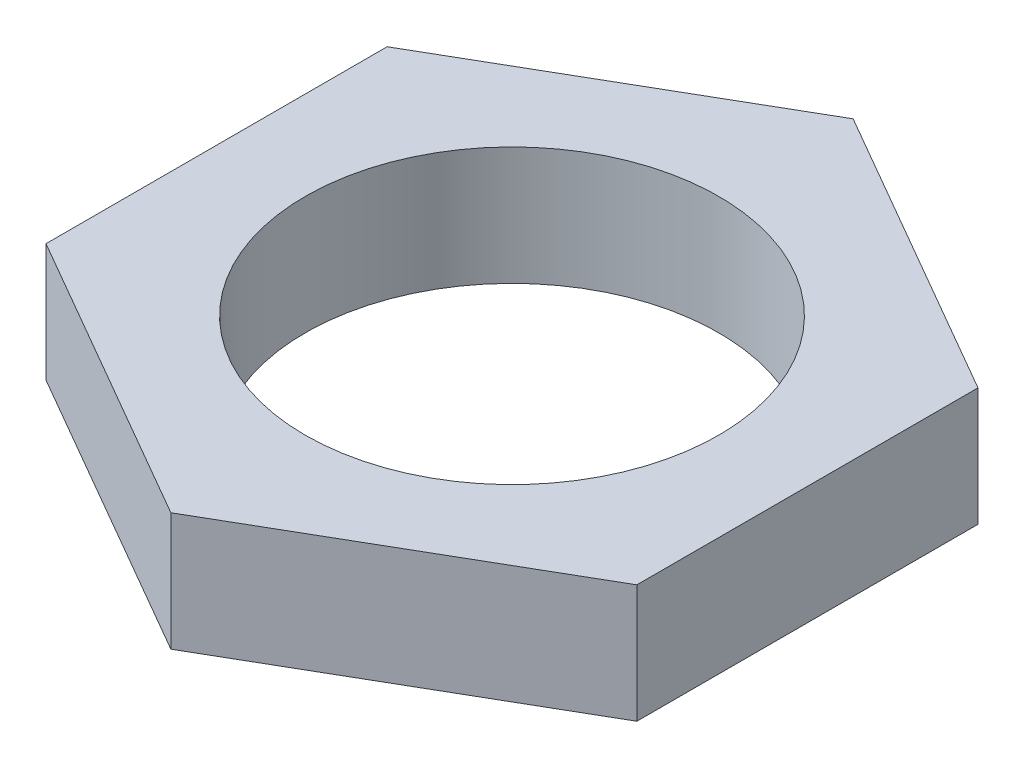
ISO-10303-21;
HEADER;
FILE_DESCRIPTION(('STEP AP214'),'2;1');
FILE_NAME('part.step','',(''),(''),'','','');
FILE_SCHEMA(('AUTOMOTIVE_DESIGN { 1 0 10303 214 1 1 1 1 }'));
ENDSEC;
DATA;
#1=APPLICATION_CONTEXT('core data for automotive mechanical design processes');
#2=APPLICATION_PROTOCOL_DEFINITION('international standard','automotive_design',2000,#1);
#3=PRODUCT_CONTEXT('',#1,'mechanical');
#4=PRODUCT('Part','Part','',(#3));
#5=PRODUCT_RELATED_PRODUCT_CATEGORY('part','',(#4));
#6=PRODUCT_DEFINITION_FORMATION('','',#4);
#7=PRODUCT_DEFINITION_CONTEXT('part definition',#1,'design');
#8=PRODUCT_DEFINITION('design','',#6,#7);
#9=PRODUCT_DEFINITION_SHAPE('','',#8);
#10=(LENGTH_UNIT() NAMED_UNIT(*) SI_UNIT(.MILLI.,.METRE.));
#11=(NAMED_UNIT(*) PLANE_ANGLE_UNIT() SI_UNIT($,.RADIAN.));
#12=(NAMED_UNIT(*) SI_UNIT($,.STERADIAN.) SOLID_ANGLE_UNIT());
#13=UNCERTAINTY_MEASURE_WITH_UNIT(LENGTH_MEASURE(1.E-05),#10,'distance_accuracy_value','');
#14=(GEOMETRIC_REPRESENTATION_CONTEXT(3) GLOBAL_UNCERTAINTY_ASSIGNED_CONTEXT((#13)) GLOBAL_UNIT_ASSIGNED_CONTEXT((#10,
#11,#12)) REPRESENTATION_CONTEXT('',''));
#15=CARTESIAN_POINT('',(0.,0.,0.));
#16=DIRECTION('',(0.,0.,1.));
#17=DIRECTION('',(1.,0.,0.));
#18=AXIS2_PLACEMENT_3D('',#15,#16,#17);
#19=CARTESIAN_POINT('',(0.,4.7625,0.));
#20=DIRECTION('',(0.,1.,0.));
#21=DIRECTION('',(0.,0.,1.));
#22=AXIS2_PLACEMENT_3D('',#19,#20,#21);
#23=PLANE('',#22);
#24=DIRECTION('',(-0.866025403784441,0.,-0.499999999999995));
#25=VECTOR('',#24,1.);
#26=CARTESIAN_POINT('',(23.8124999999999,4.7625,-13.7481532850782));
#27=LINE('',#26,#25);
#28=CARTESIAN_POINT('',(23.8124999999999,4.7625,-13.7481532850782));
#29=VERTEX_POINT('',#28);
#30=CARTESIAN_POINT('',(0.,4.7625,-27.4963065701559));
#31=VERTEX_POINT('',#30);
#32=EDGE_CURVE('E129',#29,#31,#27,.T.);
#33=ORIENTED_EDGE('',*,*,#32,.T.);
#34=DIRECTION('',(-0.866025403784438,0.,0.500000000000001));
#35=VECTOR('',#34,1.);
#36=CARTESIAN_POINT('',(0.,4.7625,-27.4963065701559));
#37=LINE('',#36,#35);
#38=CARTESIAN_POINT('',(-23.8125,4.7625,-13.7481532850779));
#39=VERTEX_POINT('',#38);
#40=EDGE_CURVE('E87',#31,#39,#37,.T.);
#41=ORIENTED_EDGE('',*,*,#40,.T.);
#42=DIRECTION('',(0.,0.,1.));
#43=VECTOR('',#42,1.);
#44=CARTESIAN_POINT('',(-23.8125,4.7625,-13.7481532850779));
#45=LINE('',#44,#43);
#46=CARTESIAN_POINT('',(-23.8124999999999,4.7625,13.7481532850781));
#47=VERTEX_POINT('',#46);
#48=EDGE_CURVE('E100',#39,#47,#45,.T.);
#49=ORIENTED_EDGE('',*,*,#48,.T.);
#50=DIRECTION('',(0.866025403784441,0.,0.499999999999995));
#51=VECTOR('',#50,1.);
#52=CARTESIAN_POINT('',(-23.8124999999999,4.7625,13.7481532850781));
#53=LINE('',#52,#51);
#54=CARTESIAN_POINT('',(1.92005682553619E-13,4.7625,27.4963065701559));
#55=VERTEX_POINT('',#54);
#56=EDGE_CURVE('E94',#47,#55,#53,.T.);
#57=ORIENTED_EDGE('',*,*,#56,.T.);
#58=DIRECTION('',(0.866025403784434,0.,-0.500000000000007));
#59=VECTOR('',#58,1.);
#60=CARTESIAN_POINT('',(1.92005682553619E-13,4.7625,27.4963065701559));
#61=LINE('',#60,#59);
#62=CARTESIAN_POINT('',(23.8125000000001,4.7625,13.7481532850777));
#63=VERTEX_POINT('',#62);
#64=EDGE_CURVE('E98',#55,#63,#61,.T.);
#65=ORIENTED_EDGE('',*,*,#64,.T.);
#66=DIRECTION('',(0.,0.,-1.));
#67=VECTOR('',#66,1.);
#68=CARTESIAN_POINT('',(23.8125000000001,4.7625,13.7481532850777));
#69=LINE('',#68,#67);
#70=EDGE_CURVE('E50',#63,#29,#69,.T.);
#71=ORIENTED_EDGE('',*,*,#70,.T.);
#72=EDGE_LOOP('',(#33,#41,#49,#57,#65,#71));
#73=FACE_BOUND('',#72,.T.);
#74=CARTESIAN_POINT('',(0.,4.7625,0.));
#75=DIRECTION('',(0.,1.,0.));
#76=DIRECTION('',(0.,0.,1.));
#77=AXIS2_PLACEMENT_3D('',#74,#75,#76);
#78=CIRCLE('',#77,16.66875);
#79=CARTESIAN_POINT('',(0.,4.7625,16.66875));
#80=VERTEX_POINT('',#79);
#81=EDGE_CURVE('E122',#80,#80,#78,.T.);
#82=ORIENTED_EDGE('',*,*,#81,.F.);
#83=EDGE_LOOP('',(#82));
#84=FACE_BOUND('',#83,.T.);
#85=ADVANCED_FACE('F33',(#73,#84),#23,.T.);
#86=CARTESIAN_POINT('',(0.,-4.7625,0.));
#87=DIRECTION('',(0.,1.,0.));
#88=DIRECTION('',(0.,0.,1.));
#89=AXIS2_PLACEMENT_3D('',#86,#87,#88);
#90=PLANE('',#89);
#91=DIRECTION('',(-0.866025403784441,0.,-0.499999999999995));
#92=VECTOR('',#91,1.);
#93=CARTESIAN_POINT('',(23.8124999999999,-4.7625,-13.7481532850782));
#94=LINE('',#93,#92);
#95=CARTESIAN_POINT('',(23.8124999999999,-4.7625,-13.7481532850782));
#96=VERTEX_POINT('',#95);
#97=CARTESIAN_POINT('',(0.,-4.7625,-27.4963065701559));
#98=VERTEX_POINT('',#97);
#99=EDGE_CURVE('E118',#96,#98,#94,.T.);
#100=ORIENTED_EDGE('',*,*,#99,.F.);
#101=DIRECTION('',(0.,0.,-1.));
#102=VECTOR('',#101,1.);
#103=CARTESIAN_POINT('',(23.8125000000001,-4.7625,13.7481532850777));
#104=LINE('',#103,#102);
#105=CARTESIAN_POINT('',(23.8125000000001,-4.7625,13.7481532850777));
#106=VERTEX_POINT('',#105);
#107=EDGE_CURVE('E79',#106,#96,#104,.T.);
#108=ORIENTED_EDGE('',*,*,#107,.F.);
#109=DIRECTION('',(0.866025403784434,0.,-0.500000000000007));
#110=VECTOR('',#109,1.);
#111=CARTESIAN_POINT('',(1.92005682553619E-13,-4.7625,27.4963065701559));
#112=LINE('',#111,#110);
#113=CARTESIAN_POINT('',(1.92005682553619E-13,-4.7625,27.4963065701559));
#114=VERTEX_POINT('',#113);
#115=EDGE_CURVE('E73',#114,#106,#112,.T.);
#116=ORIENTED_EDGE('',*,*,#115,.F.);
#117=DIRECTION('',(0.866025403784441,0.,0.499999999999995));
#118=VECTOR('',#117,1.);
#119=CARTESIAN_POINT('',(-23.8124999999999,-4.7625,13.7481532850781));
#120=LINE('',#119,#118);
#121=CARTESIAN_POINT('',(-23.8124999999999,-4.7625,13.7481532850781));
#122=VERTEX_POINT('',#121);
#123=EDGE_CURVE('E108',#122,#114,#120,.T.);
#124=ORIENTED_EDGE('',*,*,#123,.F.);
#125=DIRECTION('',(0.,0.,1.));
#126=VECTOR('',#125,1.);
#127=CARTESIAN_POINT('',(-23.8125,-4.7625,-13.7481532850779));
#128=LINE('',#127,#126);
#129=CARTESIAN_POINT('',(-23.8125,-4.7625,-13.7481532850779));
#130=VERTEX_POINT('',#129);
#131=EDGE_CURVE('E124',#130,#122,#128,.T.);
#132=ORIENTED_EDGE('',*,*,#131,.F.);
#133=DIRECTION('',(-0.866025403784438,0.,0.500000000000001));
#134=VECTOR('',#133,1.);
#135=CARTESIAN_POINT('',(0.,-4.7625,-27.4963065701559));
#136=LINE('',#135,#134);
#137=EDGE_CURVE('E121',#98,#130,#136,.T.);
#138=ORIENTED_EDGE('',*,*,#137,.F.);
#139=EDGE_LOOP('',(#100,#108,#116,#124,#132,#138));
#140=FACE_BOUND('',#139,.T.);
#141=CARTESIAN_POINT('',(0.,-4.7625,0.));
#142=DIRECTION('',(0.,1.,0.));
#143=DIRECTION('',(0.,0.,1.));
#144=AXIS2_PLACEMENT_3D('',#141,#142,#143);
#145=CIRCLE('',#144,16.66875);
#146=CARTESIAN_POINT('',(0.,-4.7625,16.66875));
#147=VERTEX_POINT('',#146);
#148=EDGE_CURVE('E222',#147,#147,#145,.T.);
#149=ORIENTED_EDGE('',*,*,#148,.T.);
#150=EDGE_LOOP('',(#149));
#151=FACE_BOUND('',#150,.T.);
#152=ADVANCED_FACE('F138',(#140,#151),#90,.F.);
#153=CARTESIAN_POINT('',(23.8124999999999,4.7625,-13.7481532850782));
#154=DIRECTION('',(-0.499999999999995,0.,0.866025403784442));
#155=DIRECTION('',(0.866025403784442,0.,0.499999999999995));
#156=AXIS2_PLACEMENT_3D('',#153,#154,#155);
#157=PLANE('',#156);
#158=ORIENTED_EDGE('',*,*,#99,.T.);
#159=DIRECTION('',(0.,-1.,0.));
#160=VECTOR('',#159,1.);
#161=CARTESIAN_POINT('',(0.,4.7625,-27.4963065701559));
#162=LINE('',#161,#160);
#163=EDGE_CURVE('E11',#31,#98,#162,.T.);
#164=ORIENTED_EDGE('',*,*,#163,.F.);
#165=ORIENTED_EDGE('',*,*,#32,.F.);
#166=DIRECTION('',(0.,-1.,0.));
#167=VECTOR('',#166,1.);
#168=CARTESIAN_POINT('',(23.8124999999999,4.7625,-13.7481532850782));
#169=LINE('',#168,#167);
#170=EDGE_CURVE('E114',#29,#96,#169,.T.);
#171=ORIENTED_EDGE('',*,*,#170,.T.);
#172=EDGE_LOOP('',(#158,#164,#165,#171));
#173=FACE_BOUND('',#172,.T.);
#174=ADVANCED_FACE('F35',(#173),#157,.F.);
#175=CARTESIAN_POINT('',(0.,4.7625,-27.4963065701559));
#176=DIRECTION('',(0.500000000000001,0.,0.866025403784438));
#177=DIRECTION('',(0.866025403784438,0.,-0.500000000000001));
#178=AXIS2_PLACEMENT_3D('',#175,#176,#177);
#179=PLANE('',#178);
#180=ORIENTED_EDGE('',*,*,#137,.T.);
#181=DIRECTION('',(0.,-1.,0.));
#182=VECTOR('',#181,1.);
#183=CARTESIAN_POINT('',(-23.8125,4.7625,-13.7481532850779));
#184=LINE('',#183,#182);
#185=EDGE_CURVE('E42',#39,#130,#184,.T.);
#186=ORIENTED_EDGE('',*,*,#185,.F.);
#187=ORIENTED_EDGE('',*,*,#40,.F.);
#188=ORIENTED_EDGE('',*,*,#163,.T.);
#189=EDGE_LOOP('',(#180,#186,#187,#188));
#190=FACE_BOUND('',#189,.T.);
#191=ADVANCED_FACE('F163',(#190),#179,.F.);
#192=CARTESIAN_POINT('',(-23.8125,4.7625,-13.7481532850779));
#193=DIRECTION('',(1.,0.,0.));
#194=DIRECTION('',(0.,0.,-1.));
#195=AXIS2_PLACEMENT_3D('',#192,#193,#194);
#196=PLANE('',#195);
#197=ORIENTED_EDGE('',*,*,#131,.T.);
#198=DIRECTION('',(0.,-1.,0.));
#199=VECTOR('',#198,1.);
#200=CARTESIAN_POINT('',(-23.8124999999999,4.7625,13.7481532850781));
#201=LINE('',#200,#199);
#202=EDGE_CURVE('E109',#47,#122,#201,.T.);
#203=ORIENTED_EDGE('',*,*,#202,.F.);
#204=ORIENTED_EDGE('',*,*,#48,.F.);
#205=ORIENTED_EDGE('',*,*,#185,.T.);
#206=EDGE_LOOP('',(#197,#203,#204,#205));
#207=FACE_BOUND('',#206,.T.);
#208=ADVANCED_FACE('F135',(#207),#196,.F.);
#209=CARTESIAN_POINT('',(-23.8124999999999,4.7625,13.7481532850781));
#210=DIRECTION('',(0.499999999999995,0.,-0.866025403784442));
#211=DIRECTION('',(-0.866025403784442,0.,-0.499999999999995));
#212=AXIS2_PLACEMENT_3D('',#209,#210,#211);
#213=PLANE('',#212);
#214=ORIENTED_EDGE('',*,*,#123,.T.);
#215=DIRECTION('',(0.,-1.,0.));
#216=VECTOR('',#215,1.);
#217=CARTESIAN_POINT('',(1.92005682553619E-13,4.7625,27.4963065701559));
#218=LINE('',#217,#216);
#219=EDGE_CURVE('E105',#55,#114,#218,.T.);
#220=ORIENTED_EDGE('',*,*,#219,.F.);
#221=ORIENTED_EDGE('',*,*,#56,.F.);
#222=ORIENTED_EDGE('',*,*,#202,.T.);
#223=EDGE_LOOP('',(#214,#220,#221,#222));
#224=FACE_BOUND('',#223,.T.);
#225=ADVANCED_FACE('F106',(#224),#213,.F.);
#226=CARTESIAN_POINT('',(1.92005682553619E-13,4.7625,27.4963065701559));
#227=DIRECTION('',(-0.500000000000007,0.,-0.866025403784435));
#228=DIRECTION('',(-0.866025403784434,0.,0.500000000000007));
#229=AXIS2_PLACEMENT_3D('',#226,#227,#228);
#230=PLANE('',#229);
#231=ORIENTED_EDGE('',*,*,#115,.T.);
#232=DIRECTION('',(0.,-1.,0.));
#233=VECTOR('',#232,1.);
#234=CARTESIAN_POINT('',(23.8125000000001,4.7625,13.7481532850777));
#235=LINE('',#234,#233);
#236=EDGE_CURVE('E110',#63,#106,#235,.T.);
#237=ORIENTED_EDGE('',*,*,#236,.F.);
#238=ORIENTED_EDGE('',*,*,#64,.F.);
#239=ORIENTED_EDGE('',*,*,#219,.T.);
#240=EDGE_LOOP('',(#231,#237,#238,#239));
#241=FACE_BOUND('',#240,.T.);
#242=ADVANCED_FACE('F112',(#241),#230,.F.);
#243=CARTESIAN_POINT('',(23.8125000000001,4.7625,13.7481532850777));
#244=DIRECTION('',(-1.,0.,0.));
#245=DIRECTION('',(0.,0.,1.));
#246=AXIS2_PLACEMENT_3D('',#243,#244,#245);
#247=PLANE('',#246);
#248=ORIENTED_EDGE('',*,*,#107,.T.);
#249=ORIENTED_EDGE('',*,*,#170,.F.);
#250=ORIENTED_EDGE('',*,*,#70,.F.);
#251=ORIENTED_EDGE('',*,*,#236,.T.);
#252=EDGE_LOOP('',(#248,#249,#250,#251));
#253=FACE_BOUND('',#252,.T.);
#254=ADVANCED_FACE('F143',(#253),#247,.F.);
#255=CARTESIAN_POINT('',(0.,4.7625,0.));
#256=DIRECTION('',(0.,-1.,0.));
#257=DIRECTION('',(0.,0.,-1.));
#258=AXIS2_PLACEMENT_3D('',#255,#256,#257);
#259=CYLINDRICAL_SURFACE('',#258,16.66875);
#260=ORIENTED_EDGE('',*,*,#81,.T.);
#261=EDGE_LOOP('',(#260));
#262=FACE_BOUND('',#261,.T.);
#263=ORIENTED_EDGE('',*,*,#148,.F.);
#264=EDGE_LOOP('',(#263));
#265=FACE_BOUND('',#264,.T.);
#266=ADVANCED_FACE('F145',(#262,#265),#259,.F.);
#267=CLOSED_SHELL('',(#85,#152,#174,#191,#208,#225,#242,#254,#266));
#268=MANIFOLD_SOLID_BREP('B2',#267);
#269=ADVANCED_BREP_SHAPE_REPRESENTATION('',(#18,#268),#14);
#270=SHAPE_DEFINITION_REPRESENTATION(#9,#269);
ENDSEC;
END-ISO-10303-21;
